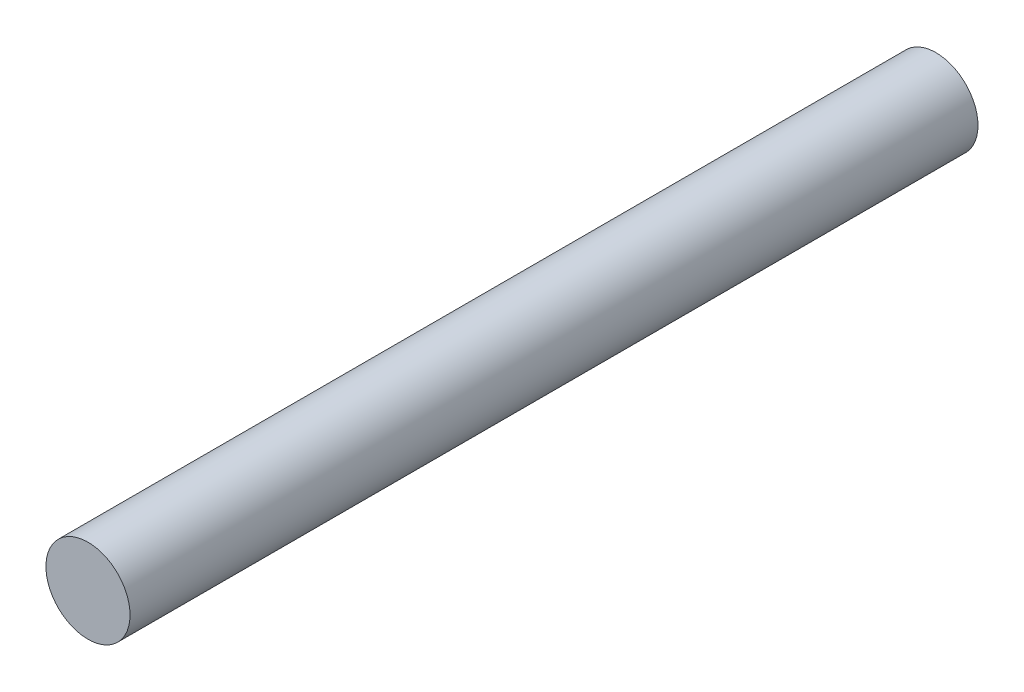
ISO-10303-21;
HEADER;
FILE_DESCRIPTION(('STEP AP214'),'2;1');
FILE_NAME('part.step','',(''),(''),'','','');
FILE_SCHEMA(('AUTOMOTIVE_DESIGN { 1 0 10303 214 1 1 1 1 }'));
ENDSEC;
DATA;
#1=APPLICATION_CONTEXT('core data for automotive mechanical design processes');
#2=APPLICATION_PROTOCOL_DEFINITION('international standard','automotive_design',2000,#1);
#3=PRODUCT_CONTEXT('',#1,'mechanical');
#4=PRODUCT('Part','Part','',(#3));
#5=PRODUCT_RELATED_PRODUCT_CATEGORY('part','',(#4));
#6=PRODUCT_DEFINITION_FORMATION('','',#4);
#7=PRODUCT_DEFINITION_CONTEXT('part definition',#1,'design');
#8=PRODUCT_DEFINITION('design','',#6,#7);
#9=PRODUCT_DEFINITION_SHAPE('','',#8);
#10=(LENGTH_UNIT() NAMED_UNIT(*) SI_UNIT(.MILLI.,.METRE.));
#11=(NAMED_UNIT(*) PLANE_ANGLE_UNIT() SI_UNIT($,.RADIAN.));
#12=(NAMED_UNIT(*) SI_UNIT($,.STERADIAN.) SOLID_ANGLE_UNIT());
#13=UNCERTAINTY_MEASURE_WITH_UNIT(LENGTH_MEASURE(1.E-05),#10,'distance_accuracy_value','');
#14=(GEOMETRIC_REPRESENTATION_CONTEXT(3) GLOBAL_UNCERTAINTY_ASSIGNED_CONTEXT((#13)) GLOBAL_UNIT_ASSIGNED_CONTEXT((#10,
#11,#12)) REPRESENTATION_CONTEXT('',''));
#15=CARTESIAN_POINT('',(0.,0.,0.));
#16=DIRECTION('',(0.,0.,1.));
#17=DIRECTION('',(1.,0.,0.));
#18=AXIS2_PLACEMENT_3D('',#15,#16,#17);
#19=CARTESIAN_POINT('',(0.,0.,125.));
#20=DIRECTION('',(0.,0.,-1.));
#21=DIRECTION('',(-1.,0.,0.));
#22=AXIS2_PLACEMENT_3D('',#19,#20,#21);
#23=CYLINDRICAL_SURFACE('',#22,6.2);
#24=CARTESIAN_POINT('',(0.,0.,125.));
#25=DIRECTION('',(0.,0.,1.));
#26=DIRECTION('',(1.,0.,0.));
#27=AXIS2_PLACEMENT_3D('',#24,#25,#26);
#28=CIRCLE('',#27,6.2);
#29=CARTESIAN_POINT('',(6.2,0.,125.));
#30=VERTEX_POINT('',#29);
#31=EDGE_CURVE('E10',#30,#30,#28,.T.);
#32=ORIENTED_EDGE('',*,*,#31,.F.);
#33=EDGE_LOOP('',(#32));
#34=FACE_BOUND('',#33,.T.);
#35=CARTESIAN_POINT('',(0.,0.,0.));
#36=DIRECTION('',(0.,0.,1.));
#37=DIRECTION('',(1.,0.,0.));
#38=AXIS2_PLACEMENT_3D('',#35,#36,#37);
#39=CIRCLE('',#38,6.2);
#40=CARTESIAN_POINT('',(6.2,0.,0.));
#41=VERTEX_POINT('',#40);
#42=EDGE_CURVE('E40',#41,#41,#39,.T.);
#43=ORIENTED_EDGE('',*,*,#42,.T.);
#44=EDGE_LOOP('',(#43));
#45=FACE_BOUND('',#44,.T.);
#46=ADVANCED_FACE('F37',(#34,#45),#23,.T.);
#47=CARTESIAN_POINT('',(0.,0.,125.));
#48=DIRECTION('',(0.,0.,1.));
#49=DIRECTION('',(1.,0.,0.));
#50=AXIS2_PLACEMENT_3D('',#47,#48,#49);
#51=PLANE('',#50);
#52=ORIENTED_EDGE('',*,*,#31,.T.);
#53=EDGE_LOOP('',(#52));
#54=FACE_BOUND('',#53,.T.);
#55=ADVANCED_FACE('F54',(#54),#51,.T.);
#56=CARTESIAN_POINT('',(0.,0.,0.));
#57=DIRECTION('',(0.,0.,1.));
#58=DIRECTION('',(1.,0.,0.));
#59=AXIS2_PLACEMENT_3D('',#56,#57,#58);
#60=PLANE('',#59);
#61=ORIENTED_EDGE('',*,*,#42,.F.);
#62=EDGE_LOOP('',(#61));
#63=FACE_BOUND('',#62,.T.);
#64=ADVANCED_FACE('F52',(#63),#60,.F.);
#65=CLOSED_SHELL('',(#46,#55,#64));
#66=MANIFOLD_SOLID_BREP('B2',#65);
#67=ADVANCED_BREP_SHAPE_REPRESENTATION('',(#18,#66),#14);
#68=SHAPE_DEFINITION_REPRESENTATION(#9,#67);
ENDSEC;
END-ISO-10303-21;
